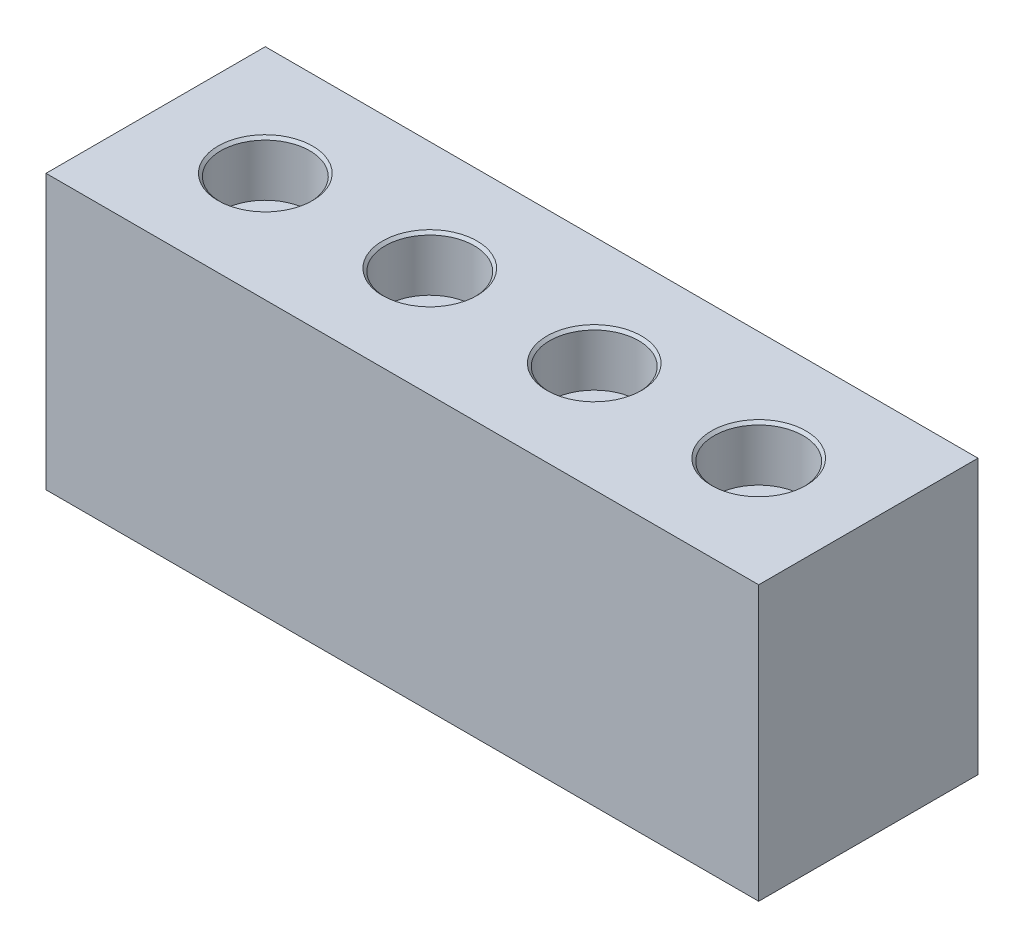
ISO-10303-21;
HEADER;
FILE_DESCRIPTION(('STEP AP214'),'2;1');
FILE_NAME('part.step','',(''),(''),'','','');
FILE_SCHEMA(('AUTOMOTIVE_DESIGN { 1 0 10303 214 1 1 1 1 }'));
ENDSEC;
DATA;
#1=APPLICATION_CONTEXT('core data for automotive mechanical design processes');
#2=APPLICATION_PROTOCOL_DEFINITION('international standard','automotive_design',2000,#1);
#3=PRODUCT_CONTEXT('',#1,'mechanical');
#4=PRODUCT('Part','Part','',(#3));
#5=PRODUCT_RELATED_PRODUCT_CATEGORY('part','',(#4));
#6=PRODUCT_DEFINITION_FORMATION('','',#4);
#7=PRODUCT_DEFINITION_CONTEXT('part definition',#1,'design');
#8=PRODUCT_DEFINITION('design','',#6,#7);
#9=PRODUCT_DEFINITION_SHAPE('','',#8);
#10=(LENGTH_UNIT() NAMED_UNIT(*) SI_UNIT(.MILLI.,.METRE.));
#11=(NAMED_UNIT(*) PLANE_ANGLE_UNIT() SI_UNIT($,.RADIAN.));
#12=(NAMED_UNIT(*) SI_UNIT($,.STERADIAN.) SOLID_ANGLE_UNIT());
#13=UNCERTAINTY_MEASURE_WITH_UNIT(LENGTH_MEASURE(1.E-05),#10,'distance_accuracy_value','');
#14=(GEOMETRIC_REPRESENTATION_CONTEXT(3) GLOBAL_UNCERTAINTY_ASSIGNED_CONTEXT((#13)) GLOBAL_UNIT_ASSIGNED_CONTEXT((#10,
#11,#12)) REPRESENTATION_CONTEXT('',''));
#15=CARTESIAN_POINT('',(0.,0.,0.));
#16=DIRECTION('',(0.,0.,1.));
#17=DIRECTION('',(1.,0.,0.));
#18=AXIS2_PLACEMENT_3D('',#15,#16,#17);
#19=CARTESIAN_POINT('',(-82.55,-31.75,25.4));
#20=DIRECTION('',(1.,0.,0.));
#21=DIRECTION('',(0.,0.,-1.));
#22=AXIS2_PLACEMENT_3D('',#19,#20,#21);
#23=PLANE('',#22);
#24=DIRECTION('',(0.,-1.,0.));
#25=VECTOR('',#24,1.);
#26=CARTESIAN_POINT('',(-82.55,-31.75,-25.4));
#27=LINE('',#26,#25);
#28=CARTESIAN_POINT('',(-82.55,31.75,-25.4));
#29=VERTEX_POINT('',#28);
#30=CARTESIAN_POINT('',(-82.55,-31.75,-25.4));
#31=VERTEX_POINT('',#30);
#32=EDGE_CURVE('E154',#29,#31,#27,.T.);
#33=ORIENTED_EDGE('',*,*,#32,.T.);
#34=DIRECTION('',(0.,0.,-1.));
#35=VECTOR('',#34,1.);
#36=CARTESIAN_POINT('',(-82.55,-31.75,25.4));
#37=LINE('',#36,#35);
#38=CARTESIAN_POINT('',(-82.55,-31.75,25.4));
#39=VERTEX_POINT('',#38);
#40=EDGE_CURVE('E11',#39,#31,#37,.T.);
#41=ORIENTED_EDGE('',*,*,#40,.F.);
#42=DIRECTION('',(0.,-1.,0.));
#43=VECTOR('',#42,1.);
#44=CARTESIAN_POINT('',(-82.55,-31.75,25.4));
#45=LINE('',#44,#43);
#46=CARTESIAN_POINT('',(-82.55,31.75,25.4));
#47=VERTEX_POINT('',#46);
#48=EDGE_CURVE('E155',#47,#39,#45,.T.);
#49=ORIENTED_EDGE('',*,*,#48,.F.);
#50=DIRECTION('',(0.,0.,-1.));
#51=VECTOR('',#50,1.);
#52=CARTESIAN_POINT('',(-82.55,31.75,25.4));
#53=LINE('',#52,#51);
#54=EDGE_CURVE('E161',#47,#29,#53,.T.);
#55=ORIENTED_EDGE('',*,*,#54,.T.);
#56=EDGE_LOOP('',(#33,#41,#49,#55));
#57=FACE_BOUND('',#56,.T.);
#58=ADVANCED_FACE('F32',(#57),#23,.F.);
#59=CARTESIAN_POINT('',(82.55,-31.75,25.4));
#60=DIRECTION('',(0.,1.,0.));
#61=DIRECTION('',(-1.,0.,0.));
#62=AXIS2_PLACEMENT_3D('',#59,#60,#61);
#63=PLANE('',#62);
#64=DIRECTION('',(1.,0.,0.));
#65=VECTOR('',#64,1.);
#66=CARTESIAN_POINT('',(82.55,-31.75,-25.4));
#67=LINE('',#66,#65);
#68=CARTESIAN_POINT('',(82.55,-31.75,-25.4));
#69=VERTEX_POINT('',#68);
#70=EDGE_CURVE('E164',#31,#69,#67,.T.);
#71=ORIENTED_EDGE('',*,*,#70,.T.);
#72=DIRECTION('',(0.,0.,-1.));
#73=VECTOR('',#72,1.);
#74=CARTESIAN_POINT('',(82.55,-31.75,25.4));
#75=LINE('',#74,#73);
#76=CARTESIAN_POINT('',(82.55,-31.75,25.4));
#77=VERTEX_POINT('',#76);
#78=EDGE_CURVE('E40',#77,#69,#75,.T.);
#79=ORIENTED_EDGE('',*,*,#78,.F.);
#80=DIRECTION('',(1.,0.,0.));
#81=VECTOR('',#80,1.);
#82=CARTESIAN_POINT('',(82.55,-31.75,25.4));
#83=LINE('',#82,#81);
#84=EDGE_CURVE('E79',#39,#77,#83,.T.);
#85=ORIENTED_EDGE('',*,*,#84,.F.);
#86=ORIENTED_EDGE('',*,*,#40,.T.);
#87=EDGE_LOOP('',(#71,#79,#85,#86));
#88=FACE_BOUND('',#87,.T.);
#89=ADVANCED_FACE('F188',(#88),#63,.F.);
#90=CARTESIAN_POINT('',(82.55,-31.75,25.4));
#91=DIRECTION('',(-1.,0.,0.));
#92=DIRECTION('',(0.,0.,1.));
#93=AXIS2_PLACEMENT_3D('',#90,#91,#92);
#94=PLANE('',#93);
#95=DIRECTION('',(0.,1.,0.));
#96=VECTOR('',#95,1.);
#97=CARTESIAN_POINT('',(82.55,-31.75,-25.4));
#98=LINE('',#97,#96);
#99=CARTESIAN_POINT('',(82.55,31.75,-25.4));
#100=VERTEX_POINT('',#99);
#101=EDGE_CURVE('E66',#69,#100,#98,.T.);
#102=ORIENTED_EDGE('',*,*,#101,.T.);
#103=DIRECTION('',(0.,0.,-1.));
#104=VECTOR('',#103,1.);
#105=CARTESIAN_POINT('',(82.55,31.75,25.4));
#106=LINE('',#105,#104);
#107=CARTESIAN_POINT('',(82.55,31.75,25.4));
#108=VERTEX_POINT('',#107);
#109=EDGE_CURVE('E169',#108,#100,#106,.T.);
#110=ORIENTED_EDGE('',*,*,#109,.F.);
#111=DIRECTION('',(0.,1.,0.));
#112=VECTOR('',#111,1.);
#113=CARTESIAN_POINT('',(82.55,-31.75,25.4));
#114=LINE('',#113,#112);
#115=EDGE_CURVE('E158',#77,#108,#114,.T.);
#116=ORIENTED_EDGE('',*,*,#115,.F.);
#117=ORIENTED_EDGE('',*,*,#78,.T.);
#118=EDGE_LOOP('',(#102,#110,#116,#117));
#119=FACE_BOUND('',#118,.T.);
#120=ADVANCED_FACE('F171',(#119),#94,.F.);
#121=CARTESIAN_POINT('',(82.55,31.75,25.4));
#122=DIRECTION('',(0.,-1.,0.));
#123=DIRECTION('',(1.,0.,0.));
#124=AXIS2_PLACEMENT_3D('',#121,#122,#123);
#125=PLANE('',#124);
#126=CARTESIAN_POINT('',(57.15,31.75,0.));
#127=DIRECTION('',(0.,1.,0.));
#128=DIRECTION('',(0.,0.,1.));
#129=AXIS2_PLACEMENT_3D('',#126,#127,#128);
#130=CIRCLE('',#129,10.95375);
#131=CARTESIAN_POINT('',(57.15,31.75,10.95375));
#132=VERTEX_POINT('',#131);
#133=EDGE_CURVE('E422',#132,#132,#130,.T.);
#134=ORIENTED_EDGE('',*,*,#133,.F.);
#135=EDGE_LOOP('',(#134));
#136=FACE_BOUND('',#135,.T.);
#137=CARTESIAN_POINT('',(19.05,31.75,0.));
#138=DIRECTION('',(0.,1.,0.));
#139=DIRECTION('',(0.,0.,1.));
#140=AXIS2_PLACEMENT_3D('',#137,#138,#139);
#141=CIRCLE('',#140,10.95375);
#142=CARTESIAN_POINT('',(19.05,31.75,10.95375));
#143=VERTEX_POINT('',#142);
#144=EDGE_CURVE('E102',#143,#143,#141,.T.);
#145=ORIENTED_EDGE('',*,*,#144,.F.);
#146=EDGE_LOOP('',(#145));
#147=FACE_BOUND('',#146,.T.);
#148=CARTESIAN_POINT('',(-19.05,31.75,0.));
#149=DIRECTION('',(0.,1.,0.));
#150=DIRECTION('',(0.,0.,1.));
#151=AXIS2_PLACEMENT_3D('',#148,#149,#150);
#152=CIRCLE('',#151,10.95375);
#153=CARTESIAN_POINT('',(-19.05,31.75,10.95375));
#154=VERTEX_POINT('',#153);
#155=EDGE_CURVE('E124',#154,#154,#152,.T.);
#156=ORIENTED_EDGE('',*,*,#155,.F.);
#157=EDGE_LOOP('',(#156));
#158=FACE_BOUND('',#157,.T.);
#159=CARTESIAN_POINT('',(-57.15,31.75,0.));
#160=DIRECTION('',(0.,1.,0.));
#161=DIRECTION('',(0.,0.,1.));
#162=AXIS2_PLACEMENT_3D('',#159,#160,#161);
#163=CIRCLE('',#162,10.95375);
#164=CARTESIAN_POINT('',(-57.15,31.75,10.95375));
#165=VERTEX_POINT('',#164);
#166=EDGE_CURVE('E139',#165,#165,#163,.T.);
#167=ORIENTED_EDGE('',*,*,#166,.F.);
#168=EDGE_LOOP('',(#167));
#169=FACE_BOUND('',#168,.T.);
#170=DIRECTION('',(-1.,0.,0.));
#171=VECTOR('',#170,1.);
#172=CARTESIAN_POINT('',(82.55,31.75,-25.4));
#173=LINE('',#172,#171);
#174=EDGE_CURVE('E72',#100,#29,#173,.T.);
#175=ORIENTED_EDGE('',*,*,#174,.T.);
#176=ORIENTED_EDGE('',*,*,#54,.F.);
#177=DIRECTION('',(-1.,0.,0.));
#178=VECTOR('',#177,1.);
#179=CARTESIAN_POINT('',(82.55,31.75,25.4));
#180=LINE('',#179,#178);
#181=EDGE_CURVE('E48',#108,#47,#180,.T.);
#182=ORIENTED_EDGE('',*,*,#181,.F.);
#183=ORIENTED_EDGE('',*,*,#109,.T.);
#184=EDGE_LOOP('',(#175,#176,#182,#183));
#185=FACE_BOUND('',#184,.T.);
#186=ADVANCED_FACE('F178',(#136,#147,#158,#169,#185),#125,.F.);
#187=CARTESIAN_POINT('',(0.,0.,25.4));
#188=DIRECTION('',(0.,0.,1.));
#189=DIRECTION('',(1.,0.,0.));
#190=AXIS2_PLACEMENT_3D('',#187,#188,#189);
#191=PLANE('',#190);
#192=ORIENTED_EDGE('',*,*,#48,.T.);
#193=ORIENTED_EDGE('',*,*,#84,.T.);
#194=ORIENTED_EDGE('',*,*,#115,.T.);
#195=ORIENTED_EDGE('',*,*,#181,.T.);
#196=EDGE_LOOP('',(#192,#193,#194,#195));
#197=FACE_BOUND('',#196,.T.);
#198=ADVANCED_FACE('F180',(#197),#191,.T.);
#199=CARTESIAN_POINT('',(0.,0.,-25.4));
#200=DIRECTION('',(0.,0.,1.));
#201=DIRECTION('',(1.,0.,0.));
#202=AXIS2_PLACEMENT_3D('',#199,#200,#201);
#203=PLANE('',#202);
#204=ORIENTED_EDGE('',*,*,#32,.F.);
#205=ORIENTED_EDGE('',*,*,#174,.F.);
#206=ORIENTED_EDGE('',*,*,#101,.F.);
#207=ORIENTED_EDGE('',*,*,#70,.F.);
#208=EDGE_LOOP('',(#204,#205,#206,#207));
#209=FACE_BOUND('',#208,.T.);
#210=ADVANCED_FACE('F174',(#209),#203,.F.);
#211=CARTESIAN_POINT('',(-57.15,-19.05,0.));
#212=DIRECTION('',(0.,1.,0.));
#213=DIRECTION('',(0.,0.,1.));
#214=AXIS2_PLACEMENT_3D('',#211,#212,#213);
#215=CONICAL_SURFACE('',#214,6.74623999999999,1.02974425867665);
#216=CARTESIAN_POINT('',(-57.15,-23.1035499425085,0.));
#217=VERTEX_POINT('',#216);
#218=VERTEX_LOOP('',#217);
#219=FACE_BOUND('',#218,.T.);
#220=CARTESIAN_POINT('',(-57.15,-19.05,0.));
#221=DIRECTION('',(0.,1.,0.));
#222=DIRECTION('',(0.,0.,1.));
#223=AXIS2_PLACEMENT_3D('',#220,#221,#222);
#224=CIRCLE('',#223,6.74623999999999);
#225=CARTESIAN_POINT('',(-57.15,-19.05,6.74623999999999));
#226=VERTEX_POINT('',#225);
#227=EDGE_CURVE('E151',#226,#226,#224,.T.);
#228=ORIENTED_EDGE('',*,*,#227,.T.);
#229=EDGE_LOOP('',(#228));
#230=FACE_BOUND('',#229,.T.);
#231=ADVANCED_FACE('F219',(#219,#230),#215,.F.);
#232=CARTESIAN_POINT('',(-57.15,31.75,0.));
#233=DIRECTION('',(0.,1.,0.));
#234=DIRECTION('',(0.,0.,1.));
#235=AXIS2_PLACEMENT_3D('',#232,#233,#234);
#236=CYLINDRICAL_SURFACE('',#235,6.74623999999999);
#237=ORIENTED_EDGE('',*,*,#227,.F.);
#238=EDGE_LOOP('',(#237));
#239=FACE_BOUND('',#238,.T.);
#240=CARTESIAN_POINT('',(-57.15,19.05,0.));
#241=DIRECTION('',(0.,1.,0.));
#242=DIRECTION('',(0.,0.,1.));
#243=AXIS2_PLACEMENT_3D('',#240,#241,#242);
#244=CIRCLE('',#243,6.74623999999999);
#245=CARTESIAN_POINT('',(-57.15,19.05,6.74623999999999));
#246=VERTEX_POINT('',#245);
#247=EDGE_CURVE('E148',#246,#246,#244,.T.);
#248=ORIENTED_EDGE('',*,*,#247,.T.);
#249=EDGE_LOOP('',(#248));
#250=FACE_BOUND('',#249,.T.);
#251=ADVANCED_FACE('F227',(#239,#250),#236,.F.);
#252=CARTESIAN_POINT('',(-50.40376,19.05,0.));
#253=DIRECTION('',(0.,-1.,0.));
#254=DIRECTION('',(0.,0.,-1.));
#255=AXIS2_PLACEMENT_3D('',#252,#253,#254);
#256=PLANE('',#255);
#257=ORIENTED_EDGE('',*,*,#247,.F.);
#258=EDGE_LOOP('',(#257));
#259=FACE_BOUND('',#258,.T.);
#260=CARTESIAN_POINT('',(-57.15,19.05,0.));
#261=DIRECTION('',(0.,1.,0.));
#262=DIRECTION('',(0.,0.,1.));
#263=AXIS2_PLACEMENT_3D('',#260,#261,#262);
#264=CIRCLE('',#263,10.31875);
#265=CARTESIAN_POINT('',(-57.15,19.05,10.31875));
#266=VERTEX_POINT('',#265);
#267=EDGE_CURVE('E145',#266,#266,#264,.T.);
#268=ORIENTED_EDGE('',*,*,#267,.T.);
#269=EDGE_LOOP('',(#268));
#270=FACE_BOUND('',#269,.T.);
#271=ADVANCED_FACE('F237',(#259,#270),#256,.F.);
#272=CARTESIAN_POINT('',(-57.15,31.75,0.));
#273=DIRECTION('',(0.,1.,0.));
#274=DIRECTION('',(0.,0.,1.));
#275=AXIS2_PLACEMENT_3D('',#272,#273,#274);
#276=CYLINDRICAL_SURFACE('',#275,10.31875);
#277=ORIENTED_EDGE('',*,*,#267,.F.);
#278=EDGE_LOOP('',(#277));
#279=FACE_BOUND('',#278,.T.);
#280=CARTESIAN_POINT('',(-57.15,31.115,0.));
#281=DIRECTION('',(0.,1.,0.));
#282=DIRECTION('',(0.,0.,1.));
#283=AXIS2_PLACEMENT_3D('',#280,#281,#282);
#284=CIRCLE('',#283,10.31875);
#285=CARTESIAN_POINT('',(-57.15,31.115,10.31875));
#286=VERTEX_POINT('',#285);
#287=EDGE_CURVE('E142',#286,#286,#284,.T.);
#288=ORIENTED_EDGE('',*,*,#287,.T.);
#289=EDGE_LOOP('',(#288));
#290=FACE_BOUND('',#289,.T.);
#291=ADVANCED_FACE('F247',(#279,#290),#276,.F.);
#292=CARTESIAN_POINT('',(-57.15,31.75,0.));
#293=DIRECTION('',(0.,1.,0.));
#294=DIRECTION('',(0.,0.,1.));
#295=AXIS2_PLACEMENT_3D('',#292,#293,#294);
#296=CONICAL_SURFACE('',#295,10.95375,0.785398163397454);
#297=ORIENTED_EDGE('',*,*,#287,.F.);
#298=EDGE_LOOP('',(#297));
#299=FACE_BOUND('',#298,.T.);
#300=ORIENTED_EDGE('',*,*,#166,.T.);
#301=EDGE_LOOP('',(#300));
#302=FACE_BOUND('',#301,.T.);
#303=ADVANCED_FACE('F257',(#299,#302),#296,.F.);
#304=CARTESIAN_POINT('',(-19.05,-19.05,0.));
#305=DIRECTION('',(0.,1.,0.));
#306=DIRECTION('',(0.,0.,1.));
#307=AXIS2_PLACEMENT_3D('',#304,#305,#306);
#308=CONICAL_SURFACE('',#307,6.74623999999999,1.02974425867665);
#309=CARTESIAN_POINT('',(-19.05,-23.1035499425085,0.));
#310=VERTEX_POINT('',#309);
#311=VERTEX_LOOP('',#310);
#312=FACE_BOUND('',#311,.T.);
#313=CARTESIAN_POINT('',(-19.05,-19.05,0.));
#314=DIRECTION('',(0.,1.,0.));
#315=DIRECTION('',(0.,0.,1.));
#316=AXIS2_PLACEMENT_3D('',#313,#314,#315);
#317=CIRCLE('',#316,6.74623999999999);
#318=CARTESIAN_POINT('',(-19.05,-19.05,6.74623999999999));
#319=VERTEX_POINT('',#318);
#320=EDGE_CURVE('E136',#319,#319,#317,.T.);
#321=ORIENTED_EDGE('',*,*,#320,.T.);
#322=EDGE_LOOP('',(#321));
#323=FACE_BOUND('',#322,.T.);
#324=ADVANCED_FACE('F266',(#312,#323),#308,.F.);
#325=CARTESIAN_POINT('',(-19.05,31.75,0.));
#326=DIRECTION('',(0.,1.,0.));
#327=DIRECTION('',(0.,0.,1.));
#328=AXIS2_PLACEMENT_3D('',#325,#326,#327);
#329=CYLINDRICAL_SURFACE('',#328,6.74623999999999);
#330=ORIENTED_EDGE('',*,*,#320,.F.);
#331=EDGE_LOOP('',(#330));
#332=FACE_BOUND('',#331,.T.);
#333=CARTESIAN_POINT('',(-19.05,19.05,0.));
#334=DIRECTION('',(0.,1.,0.));
#335=DIRECTION('',(0.,0.,1.));
#336=AXIS2_PLACEMENT_3D('',#333,#334,#335);
#337=CIRCLE('',#336,6.74623999999999);
#338=CARTESIAN_POINT('',(-19.05,19.05,6.74623999999999));
#339=VERTEX_POINT('',#338);
#340=EDGE_CURVE('E133',#339,#339,#337,.T.);
#341=ORIENTED_EDGE('',*,*,#340,.T.);
#342=EDGE_LOOP('',(#341));
#343=FACE_BOUND('',#342,.T.);
#344=ADVANCED_FACE('F280',(#332,#343),#329,.F.);
#345=CARTESIAN_POINT('',(-12.30376,19.05,0.));
#346=DIRECTION('',(0.,-1.,0.));
#347=DIRECTION('',(0.,0.,-1.));
#348=AXIS2_PLACEMENT_3D('',#345,#346,#347);
#349=PLANE('',#348);
#350=ORIENTED_EDGE('',*,*,#340,.F.);
#351=EDGE_LOOP('',(#350));
#352=FACE_BOUND('',#351,.T.);
#353=CARTESIAN_POINT('',(-19.05,19.05,0.));
#354=DIRECTION('',(0.,1.,0.));
#355=DIRECTION('',(0.,0.,1.));
#356=AXIS2_PLACEMENT_3D('',#353,#354,#355);
#357=CIRCLE('',#356,10.31875);
#358=CARTESIAN_POINT('',(-19.05,19.05,10.31875));
#359=VERTEX_POINT('',#358);
#360=EDGE_CURVE('E130',#359,#359,#357,.T.);
#361=ORIENTED_EDGE('',*,*,#360,.T.);
#362=EDGE_LOOP('',(#361));
#363=FACE_BOUND('',#362,.T.);
#364=ADVANCED_FACE('F290',(#352,#363),#349,.F.);
#365=CARTESIAN_POINT('',(-19.05,31.75,0.));
#366=DIRECTION('',(0.,1.,0.));
#367=DIRECTION('',(0.,0.,1.));
#368=AXIS2_PLACEMENT_3D('',#365,#366,#367);
#369=CYLINDRICAL_SURFACE('',#368,10.31875);
#370=ORIENTED_EDGE('',*,*,#360,.F.);
#371=EDGE_LOOP('',(#370));
#372=FACE_BOUND('',#371,.T.);
#373=CARTESIAN_POINT('',(-19.05,31.115,0.));
#374=DIRECTION('',(0.,1.,0.));
#375=DIRECTION('',(0.,0.,1.));
#376=AXIS2_PLACEMENT_3D('',#373,#374,#375);
#377=CIRCLE('',#376,10.31875);
#378=CARTESIAN_POINT('',(-19.05,31.115,10.31875));
#379=VERTEX_POINT('',#378);
#380=EDGE_CURVE('E127',#379,#379,#377,.T.);
#381=ORIENTED_EDGE('',*,*,#380,.T.);
#382=EDGE_LOOP('',(#381));
#383=FACE_BOUND('',#382,.T.);
#384=ADVANCED_FACE('F300',(#372,#383),#369,.F.);
#385=CARTESIAN_POINT('',(-19.05,31.75,0.));
#386=DIRECTION('',(0.,1.,0.));
#387=DIRECTION('',(0.,0.,1.));
#388=AXIS2_PLACEMENT_3D('',#385,#386,#387);
#389=CONICAL_SURFACE('',#388,10.95375,0.785398163397452);
#390=ORIENTED_EDGE('',*,*,#380,.F.);
#391=EDGE_LOOP('',(#390));
#392=FACE_BOUND('',#391,.T.);
#393=ORIENTED_EDGE('',*,*,#155,.T.);
#394=EDGE_LOOP('',(#393));
#395=FACE_BOUND('',#394,.T.);
#396=ADVANCED_FACE('F310',(#392,#395),#389,.F.);
#397=CARTESIAN_POINT('',(19.05,-19.05,0.));
#398=DIRECTION('',(0.,1.,0.));
#399=DIRECTION('',(0.,0.,1.));
#400=AXIS2_PLACEMENT_3D('',#397,#398,#399);
#401=CONICAL_SURFACE('',#400,6.74623999999999,1.02974425867665);
#402=CARTESIAN_POINT('',(19.05,-23.1035499425085,0.));
#403=VERTEX_POINT('',#402);
#404=VERTEX_LOOP('',#403);
#405=FACE_BOUND('',#404,.T.);
#406=CARTESIAN_POINT('',(19.05,-19.05,0.));
#407=DIRECTION('',(0.,1.,0.));
#408=DIRECTION('',(0.,0.,1.));
#409=AXIS2_PLACEMENT_3D('',#406,#407,#408);
#410=CIRCLE('',#409,6.74623999999999);
#411=CARTESIAN_POINT('',(19.05,-19.05,6.74623999999999));
#412=VERTEX_POINT('',#411);
#413=EDGE_CURVE('E121',#412,#412,#410,.T.);
#414=ORIENTED_EDGE('',*,*,#413,.T.);
#415=EDGE_LOOP('',(#414));
#416=FACE_BOUND('',#415,.T.);
#417=ADVANCED_FACE('F320',(#405,#416),#401,.F.);
#418=CARTESIAN_POINT('',(19.05,31.75,0.));
#419=DIRECTION('',(0.,1.,0.));
#420=DIRECTION('',(0.,0.,1.));
#421=AXIS2_PLACEMENT_3D('',#418,#419,#420);
#422=CYLINDRICAL_SURFACE('',#421,6.74623999999999);
#423=ORIENTED_EDGE('',*,*,#413,.F.);
#424=EDGE_LOOP('',(#423));
#425=FACE_BOUND('',#424,.T.);
#426=CARTESIAN_POINT('',(19.05,19.05,0.));
#427=DIRECTION('',(0.,1.,0.));
#428=DIRECTION('',(0.,0.,1.));
#429=AXIS2_PLACEMENT_3D('',#426,#427,#428);
#430=CIRCLE('',#429,6.74623999999999);
#431=CARTESIAN_POINT('',(19.05,19.05,6.74623999999999));
#432=VERTEX_POINT('',#431);
#433=EDGE_CURVE('E118',#432,#432,#430,.T.);
#434=ORIENTED_EDGE('',*,*,#433,.T.);
#435=EDGE_LOOP('',(#434));
#436=FACE_BOUND('',#435,.T.);
#437=ADVANCED_FACE('F330',(#425,#436),#422,.F.);
#438=CARTESIAN_POINT('',(25.79624,19.05,0.));
#439=DIRECTION('',(0.,-1.,0.));
#440=DIRECTION('',(0.,0.,-1.));
#441=AXIS2_PLACEMENT_3D('',#438,#439,#440);
#442=PLANE('',#441);
#443=ORIENTED_EDGE('',*,*,#433,.F.);
#444=EDGE_LOOP('',(#443));
#445=FACE_BOUND('',#444,.T.);
#446=CARTESIAN_POINT('',(19.05,19.05,0.));
#447=DIRECTION('',(0.,1.,0.));
#448=DIRECTION('',(0.,0.,1.));
#449=AXIS2_PLACEMENT_3D('',#446,#447,#448);
#450=CIRCLE('',#449,10.31875);
#451=CARTESIAN_POINT('',(19.05,19.05,10.31875));
#452=VERTEX_POINT('',#451);
#453=EDGE_CURVE('E115',#452,#452,#450,.T.);
#454=ORIENTED_EDGE('',*,*,#453,.T.);
#455=EDGE_LOOP('',(#454));
#456=FACE_BOUND('',#455,.T.);
#457=ADVANCED_FACE('F340',(#445,#456),#442,.F.);
#458=CARTESIAN_POINT('',(19.05,31.75,0.));
#459=DIRECTION('',(0.,1.,0.));
#460=DIRECTION('',(0.,0.,1.));
#461=AXIS2_PLACEMENT_3D('',#458,#459,#460);
#462=CYLINDRICAL_SURFACE('',#461,10.31875);
#463=ORIENTED_EDGE('',*,*,#453,.F.);
#464=EDGE_LOOP('',(#463));
#465=FACE_BOUND('',#464,.T.);
#466=CARTESIAN_POINT('',(19.05,31.115,0.));
#467=DIRECTION('',(0.,1.,0.));
#468=DIRECTION('',(0.,0.,1.));
#469=AXIS2_PLACEMENT_3D('',#466,#467,#468);
#470=CIRCLE('',#469,10.31875);
#471=CARTESIAN_POINT('',(19.05,31.115,10.31875));
#472=VERTEX_POINT('',#471);
#473=EDGE_CURVE('E106',#472,#472,#470,.T.);
#474=ORIENTED_EDGE('',*,*,#473,.T.);
#475=EDGE_LOOP('',(#474));
#476=FACE_BOUND('',#475,.T.);
#477=ADVANCED_FACE('F350',(#465,#476),#462,.F.);
#478=CARTESIAN_POINT('',(19.05,31.75,0.));
#479=DIRECTION('',(0.,1.,0.));
#480=DIRECTION('',(0.,0.,1.));
#481=AXIS2_PLACEMENT_3D('',#478,#479,#480);
#482=CONICAL_SURFACE('',#481,10.95375,0.785398163397454);
#483=ORIENTED_EDGE('',*,*,#473,.F.);
#484=EDGE_LOOP('',(#483));
#485=FACE_BOUND('',#484,.T.);
#486=ORIENTED_EDGE('',*,*,#144,.T.);
#487=EDGE_LOOP('',(#486));
#488=FACE_BOUND('',#487,.T.);
#489=ADVANCED_FACE('F96',(#485,#488),#482,.F.);
#490=CARTESIAN_POINT('',(57.15,-19.05,0.));
#491=DIRECTION('',(0.,1.,0.));
#492=DIRECTION('',(0.,0.,1.));
#493=AXIS2_PLACEMENT_3D('',#490,#491,#492);
#494=CONICAL_SURFACE('',#493,6.74623999999999,1.02974425867665);
#495=CARTESIAN_POINT('',(57.15,-23.1035499425085,0.));
#496=VERTEX_POINT('',#495);
#497=VERTEX_LOOP('',#496);
#498=FACE_BOUND('',#497,.T.);
#499=CARTESIAN_POINT('',(57.15,-19.05,0.));
#500=DIRECTION('',(0.,1.,0.));
#501=DIRECTION('',(0.,0.,1.));
#502=AXIS2_PLACEMENT_3D('',#499,#500,#501);
#503=CIRCLE('',#502,6.74623999999999);
#504=CARTESIAN_POINT('',(57.15,-19.05,6.74623999999999));
#505=VERTEX_POINT('',#504);
#506=EDGE_CURVE('E100',#505,#505,#503,.T.);
#507=ORIENTED_EDGE('',*,*,#506,.T.);
#508=EDGE_LOOP('',(#507));
#509=FACE_BOUND('',#508,.T.);
#510=ADVANCED_FACE('F92',(#498,#509),#494,.F.);
#511=CARTESIAN_POINT('',(57.15,31.75,0.));
#512=DIRECTION('',(0.,1.,0.));
#513=DIRECTION('',(0.,0.,1.));
#514=AXIS2_PLACEMENT_3D('',#511,#512,#513);
#515=CYLINDRICAL_SURFACE('',#514,6.74623999999999);
#516=ORIENTED_EDGE('',*,*,#506,.F.);
#517=EDGE_LOOP('',(#516));
#518=FACE_BOUND('',#517,.T.);
#519=CARTESIAN_POINT('',(57.15,19.05,0.));
#520=DIRECTION('',(0.,1.,0.));
#521=DIRECTION('',(0.,0.,1.));
#522=AXIS2_PLACEMENT_3D('',#519,#520,#521);
#523=CIRCLE('',#522,6.74623999999999);
#524=CARTESIAN_POINT('',(57.15,19.05,6.74623999999999));
#525=VERTEX_POINT('',#524);
#526=EDGE_CURVE('E103',#525,#525,#523,.T.);
#527=ORIENTED_EDGE('',*,*,#526,.T.);
#528=EDGE_LOOP('',(#527));
#529=FACE_BOUND('',#528,.T.);
#530=ADVANCED_FACE('F95',(#518,#529),#515,.F.);
#531=CARTESIAN_POINT('',(63.89624,19.05,0.));
#532=DIRECTION('',(0.,-1.,0.));
#533=DIRECTION('',(0.,0.,-1.));
#534=AXIS2_PLACEMENT_3D('',#531,#532,#533);
#535=PLANE('',#534);
#536=ORIENTED_EDGE('',*,*,#526,.F.);
#537=EDGE_LOOP('',(#536));
#538=FACE_BOUND('',#537,.T.);
#539=CARTESIAN_POINT('',(57.15,19.05,0.));
#540=DIRECTION('',(0.,1.,0.));
#541=DIRECTION('',(0.,0.,1.));
#542=AXIS2_PLACEMENT_3D('',#539,#540,#541);
#543=CIRCLE('',#542,10.31875);
#544=CARTESIAN_POINT('',(57.15,19.05,10.31875));
#545=VERTEX_POINT('',#544);
#546=EDGE_CURVE('E109',#545,#545,#543,.T.);
#547=ORIENTED_EDGE('',*,*,#546,.T.);
#548=EDGE_LOOP('',(#547));
#549=FACE_BOUND('',#548,.T.);
#550=ADVANCED_FACE('F384',(#538,#549),#535,.F.);
#551=CARTESIAN_POINT('',(57.15,31.75,0.));
#552=DIRECTION('',(0.,1.,0.));
#553=DIRECTION('',(0.,0.,1.));
#554=AXIS2_PLACEMENT_3D('',#551,#552,#553);
#555=CYLINDRICAL_SURFACE('',#554,10.31875);
#556=ORIENTED_EDGE('',*,*,#546,.F.);
#557=EDGE_LOOP('',(#556));
#558=FACE_BOUND('',#557,.T.);
#559=CARTESIAN_POINT('',(57.15,31.115,0.));
#560=DIRECTION('',(0.,1.,0.));
#561=DIRECTION('',(0.,0.,1.));
#562=AXIS2_PLACEMENT_3D('',#559,#560,#561);
#563=CIRCLE('',#562,10.31875);
#564=CARTESIAN_POINT('',(57.15,31.115,10.31875));
#565=VERTEX_POINT('',#564);
#566=EDGE_CURVE('E420',#565,#565,#563,.T.);
#567=ORIENTED_EDGE('',*,*,#566,.T.);
#568=EDGE_LOOP('',(#567));
#569=FACE_BOUND('',#568,.T.);
#570=ADVANCED_FACE('F393',(#558,#569),#555,.F.);
#571=CARTESIAN_POINT('',(57.15,31.75,0.));
#572=DIRECTION('',(0.,1.,0.));
#573=DIRECTION('',(0.,0.,1.));
#574=AXIS2_PLACEMENT_3D('',#571,#572,#573);
#575=CONICAL_SURFACE('',#574,10.95375,0.785398163397448);
#576=ORIENTED_EDGE('',*,*,#566,.F.);
#577=EDGE_LOOP('',(#576));
#578=FACE_BOUND('',#577,.T.);
#579=ORIENTED_EDGE('',*,*,#133,.T.);
#580=EDGE_LOOP('',(#579));
#581=FACE_BOUND('',#580,.T.);
#582=ADVANCED_FACE('F403',(#578,#581),#575,.F.);
#583=CLOSED_SHELL('',(#58,#89,#120,#186,#198,#210,#231,#251,#271,#291,#303,#324,#344,#364,#384,
#396,#417,#437,#457,#477,#489,#510,#530,#550,#570,#582));
#584=MANIFOLD_SOLID_BREP('B2',#583);
#585=ADVANCED_BREP_SHAPE_REPRESENTATION('',(#18,#584),#14);
#586=SHAPE_DEFINITION_REPRESENTATION(#9,#585);
ENDSEC;
END-ISO-10303-21;
